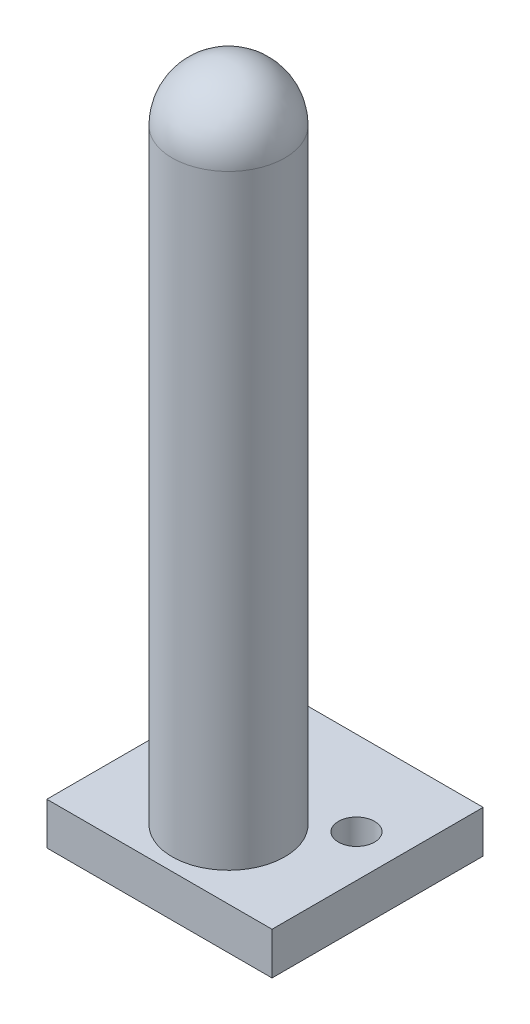
ISO-10303-21;
HEADER;
FILE_DESCRIPTION(('STEP AP214'),'2;1');
FILE_NAME('part.step','',(''),(''),'','','');
FILE_SCHEMA(('AUTOMOTIVE_DESIGN { 1 0 10303 214 1 1 1 1 }'));
ENDSEC;
DATA;
#1=APPLICATION_CONTEXT('core data for automotive mechanical design processes');
#2=APPLICATION_PROTOCOL_DEFINITION('international standard','automotive_design',2000,#1);
#3=PRODUCT_CONTEXT('',#1,'mechanical');
#4=PRODUCT('Part','Part','',(#3));
#5=PRODUCT_RELATED_PRODUCT_CATEGORY('part','',(#4));
#6=PRODUCT_DEFINITION_FORMATION('','',#4);
#7=PRODUCT_DEFINITION_CONTEXT('part definition',#1,'design');
#8=PRODUCT_DEFINITION('design','',#6,#7);
#9=PRODUCT_DEFINITION_SHAPE('','',#8);
#10=(LENGTH_UNIT() NAMED_UNIT(*) SI_UNIT(.MILLI.,.METRE.));
#11=(NAMED_UNIT(*) PLANE_ANGLE_UNIT() SI_UNIT($,.RADIAN.));
#12=(NAMED_UNIT(*) SI_UNIT($,.STERADIAN.) SOLID_ANGLE_UNIT());
#13=UNCERTAINTY_MEASURE_WITH_UNIT(LENGTH_MEASURE(1.E-05),#10,'distance_accuracy_value','');
#14=(GEOMETRIC_REPRESENTATION_CONTEXT(3) GLOBAL_UNCERTAINTY_ASSIGNED_CONTEXT((#13)) GLOBAL_UNIT_ASSIGNED_CONTEXT((#10,
#11,#12)) REPRESENTATION_CONTEXT('',''));
#15=CARTESIAN_POINT('',(0.,0.,0.));
#16=DIRECTION('',(0.,0.,1.));
#17=DIRECTION('',(1.,0.,0.));
#18=AXIS2_PLACEMENT_3D('',#15,#16,#17);
#19=CARTESIAN_POINT('',(8.,20.0841406200474,15.));
#20=DIRECTION('',(-1.,0.,0.));
#21=DIRECTION('',(0.,-1.,0.));
#22=AXIS2_PLACEMENT_3D('',#19,#20,#21);
#23=PLANE('',#22);
#24=DIRECTION('',(0.,1.,0.));
#25=VECTOR('',#24,1.);
#26=CARTESIAN_POINT('',(8.,20.0841406200474,0.));
#27=LINE('',#26,#25);
#28=CARTESIAN_POINT('',(8.,20.0841406200474,0.));
#29=VERTEX_POINT('',#28);
#30=CARTESIAN_POINT('',(8.,23.0841406200474,0.));
#31=VERTEX_POINT('',#30);
#32=EDGE_CURVE('E101',#29,#31,#27,.T.);
#33=ORIENTED_EDGE('',*,*,#32,.T.);
#34=DIRECTION('',(0.,0.,-1.));
#35=VECTOR('',#34,1.);
#36=CARTESIAN_POINT('',(8.,23.0841406200474,15.));
#37=LINE('',#36,#35);
#38=CARTESIAN_POINT('',(8.,23.0841406200474,15.));
#39=VERTEX_POINT('',#38);
#40=EDGE_CURVE('E43',#39,#31,#37,.T.);
#41=ORIENTED_EDGE('',*,*,#40,.F.);
#42=DIRECTION('',(0.,1.,0.));
#43=VECTOR('',#42,1.);
#44=CARTESIAN_POINT('',(8.,20.0841406200474,15.));
#45=LINE('',#44,#43);
#46=CARTESIAN_POINT('',(8.,20.0841406200474,15.));
#47=VERTEX_POINT('',#46);
#48=EDGE_CURVE('E87',#47,#39,#45,.T.);
#49=ORIENTED_EDGE('',*,*,#48,.F.);
#50=DIRECTION('',(0.,0.,-1.));
#51=VECTOR('',#50,1.);
#52=CARTESIAN_POINT('',(8.,20.0841406200474,15.));
#53=LINE('',#52,#51);
#54=EDGE_CURVE('E97',#47,#29,#53,.T.);
#55=ORIENTED_EDGE('',*,*,#54,.T.);
#56=EDGE_LOOP('',(#33,#41,#49,#55));
#57=FACE_BOUND('',#56,.T.);
#58=ADVANCED_FACE('F35',(#57),#23,.F.);
#59=CARTESIAN_POINT('',(8.,23.0841406200474,15.));
#60=DIRECTION('',(0.,-1.,0.));
#61=DIRECTION('',(0.,0.,-1.));
#62=AXIS2_PLACEMENT_3D('',#59,#60,#61);
#63=PLANE('',#62);
#64=CARTESIAN_POINT('',(0.,23.0841406200474,10.0922707019446));
#65=DIRECTION('',(0.,-1.,0.));
#66=DIRECTION('',(0.,0.,-1.));
#67=AXIS2_PLACEMENT_3D('',#64,#65,#66);
#68=CIRCLE('',#67,4.);
#69=CARTESIAN_POINT('',(0.,23.0841406200474,6.09227070194457));
#70=VERTEX_POINT('',#69);
#71=EDGE_CURVE('E11',#70,#70,#68,.F.);
#72=ORIENTED_EDGE('',*,*,#71,.F.);
#73=EDGE_LOOP('',(#72));
#74=FACE_BOUND('',#73,.T.);
#75=CARTESIAN_POINT('',(5.,23.0841406200474,6.));
#76=DIRECTION('',(0.,1.,0.));
#77=DIRECTION('',(0.,0.,1.));
#78=AXIS2_PLACEMENT_3D('',#75,#76,#77);
#79=CIRCLE('',#78,1.282586005021);
#80=CARTESIAN_POINT('',(5.,23.0841406200474,7.282586005021));
#81=VERTEX_POINT('',#80);
#82=EDGE_CURVE('E113',#81,#81,#79,.T.);
#83=ORIENTED_EDGE('',*,*,#82,.F.);
#84=EDGE_LOOP('',(#83));
#85=FACE_BOUND('',#84,.T.);
#86=CARTESIAN_POINT('',(-5.,23.0841406200474,6.));
#87=DIRECTION('',(0.,1.,0.));
#88=DIRECTION('',(0.,0.,-1.));
#89=AXIS2_PLACEMENT_3D('',#86,#87,#88);
#90=CIRCLE('',#89,1.282586005021);
#91=CARTESIAN_POINT('',(-5.,23.0841406200474,4.717413994979));
#92=VERTEX_POINT('',#91);
#93=EDGE_CURVE('E202',#92,#92,#90,.T.);
#94=ORIENTED_EDGE('',*,*,#93,.F.);
#95=EDGE_LOOP('',(#94));
#96=FACE_BOUND('',#95,.T.);
#97=DIRECTION('',(-1.,0.,0.));
#98=VECTOR('',#97,1.);
#99=CARTESIAN_POINT('',(8.,23.0841406200474,0.));
#100=LINE('',#99,#98);
#101=CARTESIAN_POINT('',(-8.,23.0841406200474,0.));
#102=VERTEX_POINT('',#101);
#103=EDGE_CURVE('E92',#31,#102,#100,.T.);
#104=ORIENTED_EDGE('',*,*,#103,.T.);
#105=DIRECTION('',(0.,0.,-1.));
#106=VECTOR('',#105,1.);
#107=CARTESIAN_POINT('',(-8.,23.0841406200474,15.));
#108=LINE('',#107,#106);
#109=CARTESIAN_POINT('',(-8.,23.0841406200474,15.));
#110=VERTEX_POINT('',#109);
#111=EDGE_CURVE('E90',#110,#102,#108,.T.);
#112=ORIENTED_EDGE('',*,*,#111,.F.);
#113=DIRECTION('',(-1.,0.,0.));
#114=VECTOR('',#113,1.);
#115=CARTESIAN_POINT('',(8.,23.0841406200474,15.));
#116=LINE('',#115,#114);
#117=EDGE_CURVE('E82',#39,#110,#116,.T.);
#118=ORIENTED_EDGE('',*,*,#117,.F.);
#119=ORIENTED_EDGE('',*,*,#40,.T.);
#120=EDGE_LOOP('',(#104,#112,#118,#119));
#121=FACE_BOUND('',#120,.T.);
#122=ADVANCED_FACE('F91',(#74,#85,#96,#121),#63,.F.);
#123=CARTESIAN_POINT('',(-8.,20.0841406200474,15.));
#124=DIRECTION('',(1.,0.,0.));
#125=DIRECTION('',(0.,1.,0.));
#126=AXIS2_PLACEMENT_3D('',#123,#124,#125);
#127=PLANE('',#126);
#128=DIRECTION('',(0.,-1.,0.));
#129=VECTOR('',#128,1.);
#130=CARTESIAN_POINT('',(-8.,20.0841406200474,0.));
#131=LINE('',#130,#129);
#132=CARTESIAN_POINT('',(-8.,20.0841406200474,0.));
#133=VERTEX_POINT('',#132);
#134=EDGE_CURVE('E68',#102,#133,#131,.T.);
#135=ORIENTED_EDGE('',*,*,#134,.T.);
#136=DIRECTION('',(0.,0.,-1.));
#137=VECTOR('',#136,1.);
#138=CARTESIAN_POINT('',(-8.,20.0841406200474,15.));
#139=LINE('',#138,#137);
#140=CARTESIAN_POINT('',(-8.,20.0841406200474,15.));
#141=VERTEX_POINT('',#140);
#142=EDGE_CURVE('E93',#141,#133,#139,.T.);
#143=ORIENTED_EDGE('',*,*,#142,.F.);
#144=DIRECTION('',(0.,-1.,0.));
#145=VECTOR('',#144,1.);
#146=CARTESIAN_POINT('',(-8.,20.0841406200474,15.));
#147=LINE('',#146,#145);
#148=EDGE_CURVE('E85',#110,#141,#147,.T.);
#149=ORIENTED_EDGE('',*,*,#148,.F.);
#150=ORIENTED_EDGE('',*,*,#111,.T.);
#151=EDGE_LOOP('',(#135,#143,#149,#150));
#152=FACE_BOUND('',#151,.T.);
#153=ADVANCED_FACE('F95',(#152),#127,.F.);
#154=CARTESIAN_POINT('',(-8.,20.0841406200474,15.));
#155=DIRECTION('',(0.,1.,0.));
#156=DIRECTION('',(0.,0.,1.));
#157=AXIS2_PLACEMENT_3D('',#154,#155,#156);
#158=PLANE('',#157);
#159=CARTESIAN_POINT('',(5.,20.0841406200474,6.));
#160=DIRECTION('',(0.,1.,0.));
#161=DIRECTION('',(0.,0.,1.));
#162=AXIS2_PLACEMENT_3D('',#159,#160,#161);
#163=CIRCLE('',#162,1.282586005021);
#164=CARTESIAN_POINT('',(5.,20.0841406200474,7.282586005021));
#165=VERTEX_POINT('',#164);
#166=EDGE_CURVE('E104',#165,#165,#163,.T.);
#167=ORIENTED_EDGE('',*,*,#166,.T.);
#168=EDGE_LOOP('',(#167));
#169=FACE_BOUND('',#168,.T.);
#170=CARTESIAN_POINT('',(-5.,20.0841406200474,6.));
#171=DIRECTION('',(0.,1.,0.));
#172=DIRECTION('',(0.,0.,1.));
#173=AXIS2_PLACEMENT_3D('',#170,#171,#172);
#174=CIRCLE('',#173,1.282586005021);
#175=CARTESIAN_POINT('',(-5.,20.0841406200474,7.282586005021));
#176=VERTEX_POINT('',#175);
#177=EDGE_CURVE('E111',#176,#176,#174,.T.);
#178=ORIENTED_EDGE('',*,*,#177,.T.);
#179=EDGE_LOOP('',(#178));
#180=FACE_BOUND('',#179,.T.);
#181=DIRECTION('',(1.,0.,0.));
#182=VECTOR('',#181,1.);
#183=CARTESIAN_POINT('',(-8.,20.0841406200474,0.));
#184=LINE('',#183,#182);
#185=EDGE_CURVE('E74',#133,#29,#184,.T.);
#186=ORIENTED_EDGE('',*,*,#185,.T.);
#187=ORIENTED_EDGE('',*,*,#54,.F.);
#188=DIRECTION('',(1.,0.,0.));
#189=VECTOR('',#188,1.);
#190=CARTESIAN_POINT('',(-8.,20.0841406200474,15.));
#191=LINE('',#190,#189);
#192=EDGE_CURVE('E51',#141,#47,#191,.T.);
#193=ORIENTED_EDGE('',*,*,#192,.F.);
#194=ORIENTED_EDGE('',*,*,#142,.T.);
#195=EDGE_LOOP('',(#186,#187,#193,#194));
#196=FACE_BOUND('',#195,.T.);
#197=ADVANCED_FACE('F117',(#169,#180,#196),#158,.F.);
#198=CARTESIAN_POINT('',(0.,0.,15.));
#199=DIRECTION('',(0.,0.,1.));
#200=DIRECTION('',(1.,0.,0.));
#201=AXIS2_PLACEMENT_3D('',#198,#199,#200);
#202=PLANE('',#201);
#203=ORIENTED_EDGE('',*,*,#48,.T.);
#204=ORIENTED_EDGE('',*,*,#117,.T.);
#205=ORIENTED_EDGE('',*,*,#148,.T.);
#206=ORIENTED_EDGE('',*,*,#192,.T.);
#207=EDGE_LOOP('',(#203,#204,#205,#206));
#208=FACE_BOUND('',#207,.T.);
#209=ADVANCED_FACE('F83',(#208),#202,.T.);
#210=CARTESIAN_POINT('',(0.,0.,0.));
#211=DIRECTION('',(0.,0.,1.));
#212=DIRECTION('',(1.,0.,0.));
#213=AXIS2_PLACEMENT_3D('',#210,#211,#212);
#214=PLANE('',#213);
#215=ORIENTED_EDGE('',*,*,#32,.F.);
#216=ORIENTED_EDGE('',*,*,#185,.F.);
#217=ORIENTED_EDGE('',*,*,#134,.F.);
#218=ORIENTED_EDGE('',*,*,#103,.F.);
#219=EDGE_LOOP('',(#215,#216,#217,#218));
#220=FACE_BOUND('',#219,.T.);
#221=ADVANCED_FACE('F133',(#220),#214,.F.);
#222=CARTESIAN_POINT('',(-5.,11.0841406200474,6.));
#223=DIRECTION('',(0.,1.,0.));
#224=DIRECTION('',(0.,0.,1.));
#225=AXIS2_PLACEMENT_3D('',#222,#223,#224);
#226=CYLINDRICAL_SURFACE('',#225,1.282586005021);
#227=ORIENTED_EDGE('',*,*,#93,.T.);
#228=EDGE_LOOP('',(#227));
#229=FACE_BOUND('',#228,.T.);
#230=ORIENTED_EDGE('',*,*,#177,.F.);
#231=EDGE_LOOP('',(#230));
#232=FACE_BOUND('',#231,.T.);
#233=ADVANCED_FACE('F123',(#229,#232),#226,.F.);
#234=CARTESIAN_POINT('',(5.,11.0841406200474,6.));
#235=DIRECTION('',(0.,1.,0.));
#236=DIRECTION('',(0.,0.,1.));
#237=AXIS2_PLACEMENT_3D('',#234,#235,#236);
#238=CYLINDRICAL_SURFACE('',#237,1.282586005021);
#239=ORIENTED_EDGE('',*,*,#82,.T.);
#240=EDGE_LOOP('',(#239));
#241=FACE_BOUND('',#240,.T.);
#242=ORIENTED_EDGE('',*,*,#166,.F.);
#243=EDGE_LOOP('',(#242));
#244=FACE_BOUND('',#243,.T.);
#245=ADVANCED_FACE('F120',(#241,#244),#238,.F.);
#246=CARTESIAN_POINT('',(0.,66.0841406200474,10.0922707019446));
#247=DIRECTION('',(0.,-1.,0.));
#248=DIRECTION('',(0.,0.,-1.));
#249=AXIS2_PLACEMENT_3D('',#246,#247,#248);
#250=CYLINDRICAL_SURFACE('',#249,4.);
#251=CARTESIAN_POINT('',(0.,66.0841406200474,10.0922707019446));
#252=DIRECTION('',(0.,1.,0.));
#253=DIRECTION('',(0.,0.,1.));
#254=AXIS2_PLACEMENT_3D('',#251,#252,#253);
#255=CIRCLE('',#254,4.);
#256=CARTESIAN_POINT('',(0.,66.0841406200474,14.0922707019446));
#257=VERTEX_POINT('',#256);
#258=EDGE_CURVE('E201',#257,#257,#255,.T.);
#259=ORIENTED_EDGE('',*,*,#258,.F.);
#260=EDGE_LOOP('',(#259));
#261=FACE_BOUND('',#260,.T.);
#262=ORIENTED_EDGE('',*,*,#71,.T.);
#263=EDGE_LOOP('',(#262));
#264=FACE_BOUND('',#263,.T.);
#265=ADVANCED_FACE('F122',(#261,#264),#250,.T.);
#266=CARTESIAN_POINT('',(0.,66.0841406200474,10.0922707019446));
#267=DIRECTION('',(0.,0.,-1.));
#268=DIRECTION('',(1.,0.,0.));
#269=AXIS2_PLACEMENT_3D('',#266,#267,#268);
#270=SPHERICAL_SURFACE('',#269,4.);
#271=CARTESIAN_POINT('',(0.,66.0841406200474,10.0922707019446));
#272=DIRECTION('',(0.,1.,0.));
#273=DIRECTION('',(0.,0.,1.));
#274=AXIS2_PLACEMENT_3D('',#271,#272,#273);
#275=SPHERICAL_SURFACE('',#274,4.);
#276=ORIENTED_EDGE('',*,*,#258,.T.);
#277=EDGE_LOOP('',(#276));
#278=FACE_BOUND('',#277,.T.);
#279=ADVANCED_FACE('F130',(#278),#275,.T.);
#280=CLOSED_SHELL('',(#58,#122,#153,#197,#209,#221,#233,#245,#265,#279));
#281=MANIFOLD_SOLID_BREP('B2',#280);
#282=ADVANCED_BREP_SHAPE_REPRESENTATION('',(#18,#281),#14);
#283=SHAPE_DEFINITION_REPRESENTATION(#9,#282);
ENDSEC;
END-ISO-10303-21;
